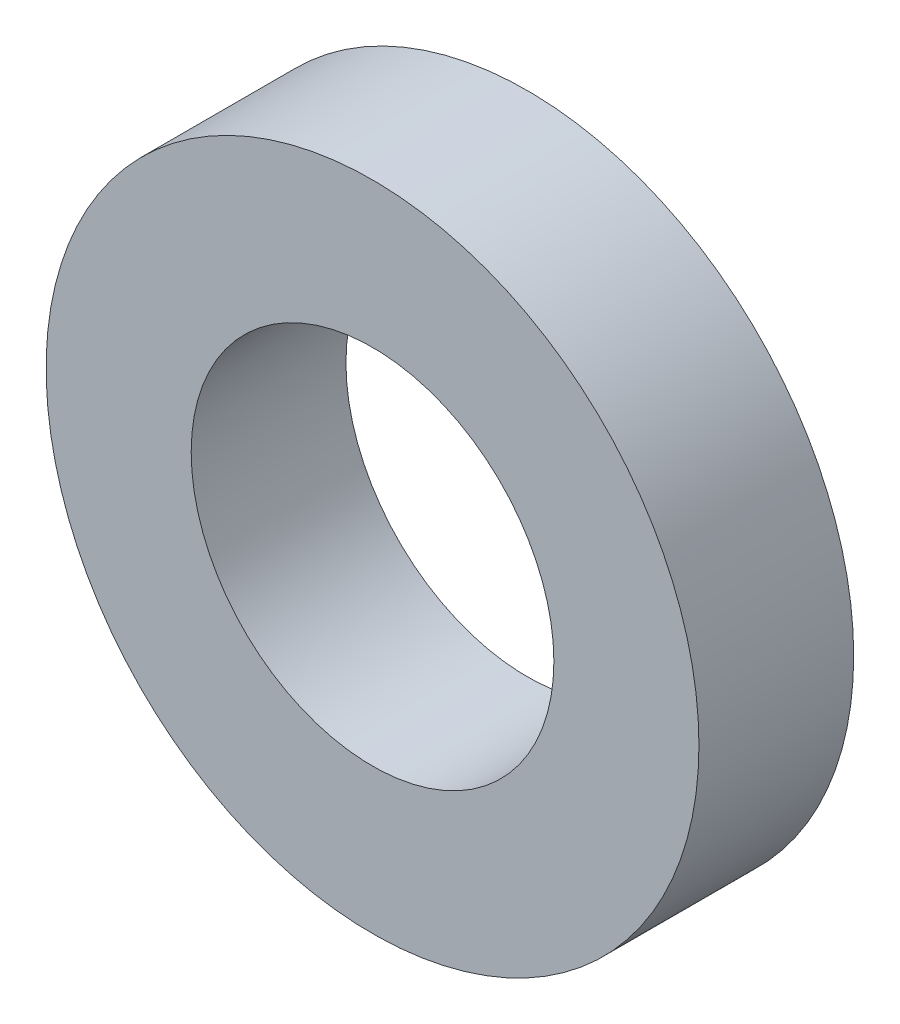
ISO-10303-21;
HEADER;
FILE_DESCRIPTION(('STEP AP214'),'2;1');
FILE_NAME('part.step','',(''),(''),'','','');
FILE_SCHEMA(('AUTOMOTIVE_DESIGN { 1 0 10303 214 1 1 1 1 }'));
ENDSEC;
DATA;
#1=APPLICATION_CONTEXT('core data for automotive mechanical design processes');
#2=APPLICATION_PROTOCOL_DEFINITION('international standard','automotive_design',2000,#1);
#3=PRODUCT_CONTEXT('',#1,'mechanical');
#4=PRODUCT('Part','Part','',(#3));
#5=PRODUCT_RELATED_PRODUCT_CATEGORY('part','',(#4));
#6=PRODUCT_DEFINITION_FORMATION('','',#4);
#7=PRODUCT_DEFINITION_CONTEXT('part definition',#1,'design');
#8=PRODUCT_DEFINITION('design','',#6,#7);
#9=PRODUCT_DEFINITION_SHAPE('','',#8);
#10=(LENGTH_UNIT() NAMED_UNIT(*) SI_UNIT(.MILLI.,.METRE.));
#11=(NAMED_UNIT(*) PLANE_ANGLE_UNIT() SI_UNIT($,.RADIAN.));
#12=(NAMED_UNIT(*) SI_UNIT($,.STERADIAN.) SOLID_ANGLE_UNIT());
#13=UNCERTAINTY_MEASURE_WITH_UNIT(LENGTH_MEASURE(1.E-05),#10,'distance_accuracy_value','');
#14=(GEOMETRIC_REPRESENTATION_CONTEXT(3) GLOBAL_UNCERTAINTY_ASSIGNED_CONTEXT((#13)) GLOBAL_UNIT_ASSIGNED_CONTEXT((#10,
#11,#12)) REPRESENTATION_CONTEXT('',''));
#15=CARTESIAN_POINT('',(0.,0.,0.));
#16=DIRECTION('',(0.,0.,1.));
#17=DIRECTION('',(1.,0.,0.));
#18=AXIS2_PLACEMENT_3D('',#15,#16,#17);
#19=CARTESIAN_POINT('',(0.,0.,3.2));
#20=DIRECTION('',(0.,0.,1.));
#21=DIRECTION('',(1.,0.,0.));
#22=AXIS2_PLACEMENT_3D('',#19,#20,#21);
#23=PLANE('',#22);
#24=CARTESIAN_POINT('',(0.,0.,3.2));
#25=DIRECTION('',(0.,0.,1.));
#26=DIRECTION('',(1.,0.,0.));
#27=AXIS2_PLACEMENT_3D('',#24,#25,#26);
#28=CIRCLE('',#27,6.75);
#29=CARTESIAN_POINT('',(6.75,0.,3.2));
#30=VERTEX_POINT('',#29);
#31=EDGE_CURVE('E10',#30,#30,#28,.T.);
#32=ORIENTED_EDGE('',*,*,#31,.T.);
#33=EDGE_LOOP('',(#32));
#34=FACE_BOUND('',#33,.T.);
#35=CARTESIAN_POINT('',(0.,0.,3.2));
#36=DIRECTION('',(0.,0.,1.));
#37=DIRECTION('',(1.,0.,0.));
#38=AXIS2_PLACEMENT_3D('',#35,#36,#37);
#39=CIRCLE('',#38,3.75);
#40=CARTESIAN_POINT('',(3.75,0.,3.2));
#41=VERTEX_POINT('',#40);
#42=EDGE_CURVE('E41',#41,#41,#39,.T.);
#43=ORIENTED_EDGE('',*,*,#42,.F.);
#44=EDGE_LOOP('',(#43));
#45=FACE_BOUND('',#44,.T.);
#46=ADVANCED_FACE('F30',(#34,#45),#23,.T.);
#47=CARTESIAN_POINT('',(0.,0.,0.));
#48=DIRECTION('',(0.,0.,1.));
#49=DIRECTION('',(1.,0.,0.));
#50=AXIS2_PLACEMENT_3D('',#47,#48,#49);
#51=PLANE('',#50);
#52=CARTESIAN_POINT('',(0.,0.,0.));
#53=DIRECTION('',(0.,0.,1.));
#54=DIRECTION('',(1.,0.,0.));
#55=AXIS2_PLACEMENT_3D('',#52,#53,#54);
#56=CIRCLE('',#55,6.75);
#57=CARTESIAN_POINT('',(6.75,0.,0.));
#58=VERTEX_POINT('',#57);
#59=EDGE_CURVE('E34',#58,#58,#56,.T.);
#60=ORIENTED_EDGE('',*,*,#59,.F.);
#61=EDGE_LOOP('',(#60));
#62=FACE_BOUND('',#61,.T.);
#63=CARTESIAN_POINT('',(0.,0.,0.));
#64=DIRECTION('',(0.,0.,1.));
#65=DIRECTION('',(1.,0.,0.));
#66=AXIS2_PLACEMENT_3D('',#63,#64,#65);
#67=CIRCLE('',#66,3.75);
#68=CARTESIAN_POINT('',(3.75,0.,0.));
#69=VERTEX_POINT('',#68);
#70=EDGE_CURVE('E43',#69,#69,#67,.T.);
#71=ORIENTED_EDGE('',*,*,#70,.T.);
#72=EDGE_LOOP('',(#71));
#73=FACE_BOUND('',#72,.T.);
#74=ADVANCED_FACE('F53',(#62,#73),#51,.F.);
#75=CARTESIAN_POINT('',(0.,0.,3.2));
#76=DIRECTION('',(0.,0.,-1.));
#77=DIRECTION('',(-1.,0.,0.));
#78=AXIS2_PLACEMENT_3D('',#75,#76,#77);
#79=CYLINDRICAL_SURFACE('',#78,6.75);
#80=ORIENTED_EDGE('',*,*,#31,.F.);
#81=EDGE_LOOP('',(#80));
#82=FACE_BOUND('',#81,.T.);
#83=ORIENTED_EDGE('',*,*,#59,.T.);
#84=EDGE_LOOP('',(#83));
#85=FACE_BOUND('',#84,.T.);
#86=ADVANCED_FACE('F32',(#82,#85),#79,.T.);
#87=CARTESIAN_POINT('',(0.,0.,3.2));
#88=DIRECTION('',(0.,0.,-1.));
#89=DIRECTION('',(-1.,0.,0.));
#90=AXIS2_PLACEMENT_3D('',#87,#88,#89);
#91=CYLINDRICAL_SURFACE('',#90,3.75);
#92=ORIENTED_EDGE('',*,*,#42,.T.);
#93=EDGE_LOOP('',(#92));
#94=FACE_BOUND('',#93,.T.);
#95=ORIENTED_EDGE('',*,*,#70,.F.);
#96=EDGE_LOOP('',(#95));
#97=FACE_BOUND('',#96,.T.);
#98=ADVANCED_FACE('F49',(#94,#97),#91,.F.);
#99=CLOSED_SHELL('',(#46,#74,#86,#98));
#100=MANIFOLD_SOLID_BREP('B2',#99);
#101=ADVANCED_BREP_SHAPE_REPRESENTATION('',(#18,#100),#14);
#102=SHAPE_DEFINITION_REPRESENTATION(#9,#101);
ENDSEC;
END-ISO-10303-21;
